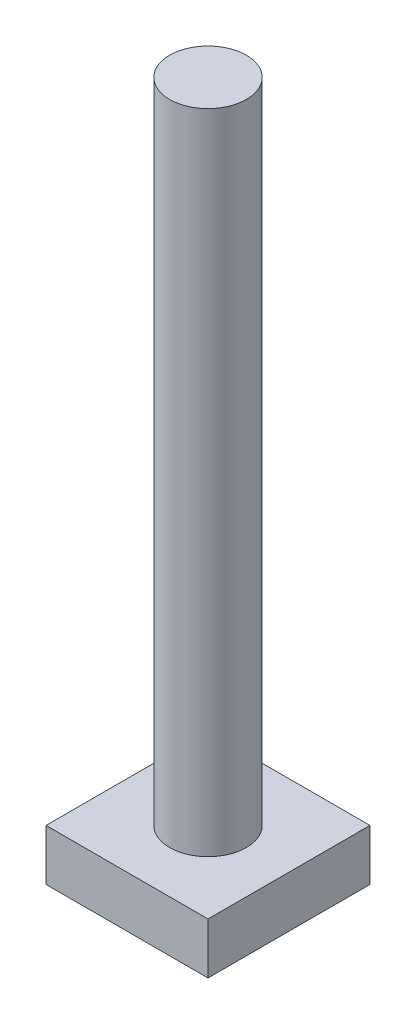
ISO-10303-21;
HEADER;
FILE_DESCRIPTION(('STEP AP214'),'2;1');
FILE_NAME('part.step','',(''),(''),'','','');
FILE_SCHEMA(('AUTOMOTIVE_DESIGN { 1 0 10303 214 1 1 1 1 }'));
ENDSEC;
DATA;
#1=APPLICATION_CONTEXT('core data for automotive mechanical design processes');
#2=APPLICATION_PROTOCOL_DEFINITION('international standard','automotive_design',2000,#1);
#3=PRODUCT_CONTEXT('',#1,'mechanical');
#4=PRODUCT('Part','Part','',(#3));
#5=PRODUCT_RELATED_PRODUCT_CATEGORY('part','',(#4));
#6=PRODUCT_DEFINITION_FORMATION('','',#4);
#7=PRODUCT_DEFINITION_CONTEXT('part definition',#1,'design');
#8=PRODUCT_DEFINITION('design','',#6,#7);
#9=PRODUCT_DEFINITION_SHAPE('','',#8);
#10=(LENGTH_UNIT() NAMED_UNIT(*) SI_UNIT(.MILLI.,.METRE.));
#11=(NAMED_UNIT(*) PLANE_ANGLE_UNIT() SI_UNIT($,.RADIAN.));
#12=(NAMED_UNIT(*) SI_UNIT($,.STERADIAN.) SOLID_ANGLE_UNIT());
#13=UNCERTAINTY_MEASURE_WITH_UNIT(LENGTH_MEASURE(1.E-05),#10,'distance_accuracy_value','');
#14=(GEOMETRIC_REPRESENTATION_CONTEXT(3) GLOBAL_UNCERTAINTY_ASSIGNED_CONTEXT((#13)) GLOBAL_UNIT_ASSIGNED_CONTEXT((#10,
#11,#12)) REPRESENTATION_CONTEXT('',''));
#15=CARTESIAN_POINT('',(0.,0.,0.));
#16=DIRECTION('',(0.,0.,1.));
#17=DIRECTION('',(1.,0.,0.));
#18=AXIS2_PLACEMENT_3D('',#15,#16,#17);
#19=CARTESIAN_POINT('',(-9.5,6.,9.5));
#20=DIRECTION('',(1.,0.,0.));
#21=DIRECTION('',(0.,0.,-1.));
#22=AXIS2_PLACEMENT_3D('',#19,#20,#21);
#23=PLANE('',#22);
#24=DIRECTION('',(0.,0.,1.));
#25=VECTOR('',#24,1.);
#26=CARTESIAN_POINT('',(-9.5,0.,9.5));
#27=LINE('',#26,#25);
#28=CARTESIAN_POINT('',(-9.5,0.,-9.5));
#29=VERTEX_POINT('',#28);
#30=CARTESIAN_POINT('',(-9.5,0.,9.5));
#31=VERTEX_POINT('',#30);
#32=EDGE_CURVE('E96',#29,#31,#27,.T.);
#33=ORIENTED_EDGE('',*,*,#32,.T.);
#34=DIRECTION('',(0.,-1.,0.));
#35=VECTOR('',#34,1.);
#36=CARTESIAN_POINT('',(-9.5,6.,9.5));
#37=LINE('',#36,#35);
#38=CARTESIAN_POINT('',(-9.5,6.,9.5));
#39=VERTEX_POINT('',#38);
#40=EDGE_CURVE('E11',#39,#31,#37,.T.);
#41=ORIENTED_EDGE('',*,*,#40,.F.);
#42=DIRECTION('',(0.,0.,1.));
#43=VECTOR('',#42,1.);
#44=CARTESIAN_POINT('',(-9.5,6.,9.5));
#45=LINE('',#44,#43);
#46=CARTESIAN_POINT('',(-9.5,6.,-9.5));
#47=VERTEX_POINT('',#46);
#48=EDGE_CURVE('E84',#47,#39,#45,.T.);
#49=ORIENTED_EDGE('',*,*,#48,.F.);
#50=DIRECTION('',(0.,-1.,0.));
#51=VECTOR('',#50,1.);
#52=CARTESIAN_POINT('',(-9.5,6.,-9.5));
#53=LINE('',#52,#51);
#54=EDGE_CURVE('E92',#47,#29,#53,.T.);
#55=ORIENTED_EDGE('',*,*,#54,.T.);
#56=EDGE_LOOP('',(#33,#41,#49,#55));
#57=FACE_BOUND('',#56,.T.);
#58=ADVANCED_FACE('F33',(#57),#23,.F.);
#59=CARTESIAN_POINT('',(9.5,6.,9.5));
#60=DIRECTION('',(0.,0.,-1.));
#61=DIRECTION('',(-1.,0.,0.));
#62=AXIS2_PLACEMENT_3D('',#59,#60,#61);
#63=PLANE('',#62);
#64=DIRECTION('',(1.,0.,0.));
#65=VECTOR('',#64,1.);
#66=CARTESIAN_POINT('',(9.5,0.,9.5));
#67=LINE('',#66,#65);
#68=CARTESIAN_POINT('',(9.5,0.,9.5));
#69=VERTEX_POINT('',#68);
#70=EDGE_CURVE('E88',#31,#69,#67,.T.);
#71=ORIENTED_EDGE('',*,*,#70,.T.);
#72=DIRECTION('',(0.,-1.,0.));
#73=VECTOR('',#72,1.);
#74=CARTESIAN_POINT('',(9.5,6.,9.5));
#75=LINE('',#74,#73);
#76=CARTESIAN_POINT('',(9.5,6.,9.5));
#77=VERTEX_POINT('',#76);
#78=EDGE_CURVE('E41',#77,#69,#75,.T.);
#79=ORIENTED_EDGE('',*,*,#78,.F.);
#80=DIRECTION('',(1.,0.,0.));
#81=VECTOR('',#80,1.);
#82=CARTESIAN_POINT('',(9.5,6.,9.5));
#83=LINE('',#82,#81);
#84=EDGE_CURVE('E79',#39,#77,#83,.T.);
#85=ORIENTED_EDGE('',*,*,#84,.F.);
#86=ORIENTED_EDGE('',*,*,#40,.T.);
#87=EDGE_LOOP('',(#71,#79,#85,#86));
#88=FACE_BOUND('',#87,.T.);
#89=ADVANCED_FACE('F87',(#88),#63,.F.);
#90=CARTESIAN_POINT('',(9.5,6.,9.5));
#91=DIRECTION('',(-1.,0.,0.));
#92=DIRECTION('',(0.,0.,1.));
#93=AXIS2_PLACEMENT_3D('',#90,#91,#92);
#94=PLANE('',#93);
#95=DIRECTION('',(0.,0.,-1.));
#96=VECTOR('',#95,1.);
#97=CARTESIAN_POINT('',(9.5,0.,9.5));
#98=LINE('',#97,#96);
#99=CARTESIAN_POINT('',(9.5,0.,-9.5));
#100=VERTEX_POINT('',#99);
#101=EDGE_CURVE('E66',#69,#100,#98,.T.);
#102=ORIENTED_EDGE('',*,*,#101,.T.);
#103=DIRECTION('',(0.,-1.,0.));
#104=VECTOR('',#103,1.);
#105=CARTESIAN_POINT('',(9.5,6.,-9.5));
#106=LINE('',#105,#104);
#107=CARTESIAN_POINT('',(9.5,6.,-9.5));
#108=VERTEX_POINT('',#107);
#109=EDGE_CURVE('E89',#108,#100,#106,.T.);
#110=ORIENTED_EDGE('',*,*,#109,.F.);
#111=DIRECTION('',(0.,0.,-1.));
#112=VECTOR('',#111,1.);
#113=CARTESIAN_POINT('',(9.5,6.,9.5));
#114=LINE('',#113,#112);
#115=EDGE_CURVE('E82',#77,#108,#114,.T.);
#116=ORIENTED_EDGE('',*,*,#115,.F.);
#117=ORIENTED_EDGE('',*,*,#78,.T.);
#118=EDGE_LOOP('',(#102,#110,#116,#117));
#119=FACE_BOUND('',#118,.T.);
#120=ADVANCED_FACE('F90',(#119),#94,.F.);
#121=CARTESIAN_POINT('',(9.5,6.,-9.5));
#122=DIRECTION('',(0.,0.,1.));
#123=DIRECTION('',(1.,0.,0.));
#124=AXIS2_PLACEMENT_3D('',#121,#122,#123);
#125=PLANE('',#124);
#126=DIRECTION('',(-1.,0.,0.));
#127=VECTOR('',#126,1.);
#128=CARTESIAN_POINT('',(9.5,0.,-9.5));
#129=LINE('',#128,#127);
#130=EDGE_CURVE('E72',#100,#29,#129,.T.);
#131=ORIENTED_EDGE('',*,*,#130,.T.);
#132=ORIENTED_EDGE('',*,*,#54,.F.);
#133=DIRECTION('',(-1.,0.,0.));
#134=VECTOR('',#133,1.);
#135=CARTESIAN_POINT('',(9.5,6.,-9.5));
#136=LINE('',#135,#134);
#137=EDGE_CURVE('E49',#108,#47,#136,.T.);
#138=ORIENTED_EDGE('',*,*,#137,.F.);
#139=ORIENTED_EDGE('',*,*,#109,.T.);
#140=EDGE_LOOP('',(#131,#132,#138,#139));
#141=FACE_BOUND('',#140,.T.);
#142=ADVANCED_FACE('F104',(#141),#125,.F.);
#143=CARTESIAN_POINT('',(0.,6.,0.));
#144=DIRECTION('',(0.,1.,0.));
#145=DIRECTION('',(0.,0.,1.));
#146=AXIS2_PLACEMENT_3D('',#143,#144,#145);
#147=PLANE('',#146);
#148=CARTESIAN_POINT('',(0.,6.,0.));
#149=DIRECTION('',(0.,1.,0.));
#150=DIRECTION('',(0.,0.,1.));
#151=AXIS2_PLACEMENT_3D('',#148,#149,#150);
#152=CIRCLE('',#151,4.5);
#153=CARTESIAN_POINT('',(0.,6.,4.5));
#154=VERTEX_POINT('',#153);
#155=EDGE_CURVE('E110',#154,#154,#152,.T.);
#156=ORIENTED_EDGE('',*,*,#155,.F.);
#157=EDGE_LOOP('',(#156));
#158=FACE_BOUND('',#157,.T.);
#159=ORIENTED_EDGE('',*,*,#48,.T.);
#160=ORIENTED_EDGE('',*,*,#84,.T.);
#161=ORIENTED_EDGE('',*,*,#115,.T.);
#162=ORIENTED_EDGE('',*,*,#137,.T.);
#163=EDGE_LOOP('',(#159,#160,#161,#162));
#164=FACE_BOUND('',#163,.T.);
#165=ADVANCED_FACE('F80',(#158,#164),#147,.T.);
#166=CARTESIAN_POINT('',(0.,0.,0.));
#167=DIRECTION('',(0.,1.,0.));
#168=DIRECTION('',(0.,0.,1.));
#169=AXIS2_PLACEMENT_3D('',#166,#167,#168);
#170=PLANE('',#169);
#171=ORIENTED_EDGE('',*,*,#32,.F.);
#172=ORIENTED_EDGE('',*,*,#130,.F.);
#173=ORIENTED_EDGE('',*,*,#101,.F.);
#174=ORIENTED_EDGE('',*,*,#70,.F.);
#175=EDGE_LOOP('',(#171,#172,#173,#174));
#176=FACE_BOUND('',#175,.T.);
#177=ADVANCED_FACE('F107',(#176),#170,.F.);
#178=CARTESIAN_POINT('',(0.,82.,0.));
#179=DIRECTION('',(0.,-1.,0.));
#180=DIRECTION('',(0.,0.,-1.));
#181=AXIS2_PLACEMENT_3D('',#178,#179,#180);
#182=CYLINDRICAL_SURFACE('',#181,4.5);
#183=CARTESIAN_POINT('',(0.,82.,0.));
#184=DIRECTION('',(0.,1.,0.));
#185=DIRECTION('',(0.,0.,1.));
#186=AXIS2_PLACEMENT_3D('',#183,#184,#185);
#187=CIRCLE('',#186,4.5);
#188=CARTESIAN_POINT('',(0.,82.,4.5));
#189=VERTEX_POINT('',#188);
#190=EDGE_CURVE('E99',#189,#189,#187,.T.);
#191=ORIENTED_EDGE('',*,*,#190,.F.);
#192=EDGE_LOOP('',(#191));
#193=FACE_BOUND('',#192,.T.);
#194=ORIENTED_EDGE('',*,*,#155,.T.);
#195=EDGE_LOOP('',(#194));
#196=FACE_BOUND('',#195,.T.);
#197=ADVANCED_FACE('F118',(#193,#196),#182,.T.);
#198=CARTESIAN_POINT('',(0.,82.,0.));
#199=DIRECTION('',(0.,1.,0.));
#200=DIRECTION('',(0.,0.,1.));
#201=AXIS2_PLACEMENT_3D('',#198,#199,#200);
#202=PLANE('',#201);
#203=ORIENTED_EDGE('',*,*,#190,.T.);
#204=EDGE_LOOP('',(#203));
#205=FACE_BOUND('',#204,.T.);
#206=ADVANCED_FACE('F116',(#205),#202,.T.);
#207=CLOSED_SHELL('',(#58,#89,#120,#142,#165,#177,#197,#206));
#208=MANIFOLD_SOLID_BREP('B2',#207);
#209=ADVANCED_BREP_SHAPE_REPRESENTATION('',(#18,#208),#14);
#210=SHAPE_DEFINITION_REPRESENTATION(#9,#209);
ENDSEC;
END-ISO-10303-21;
